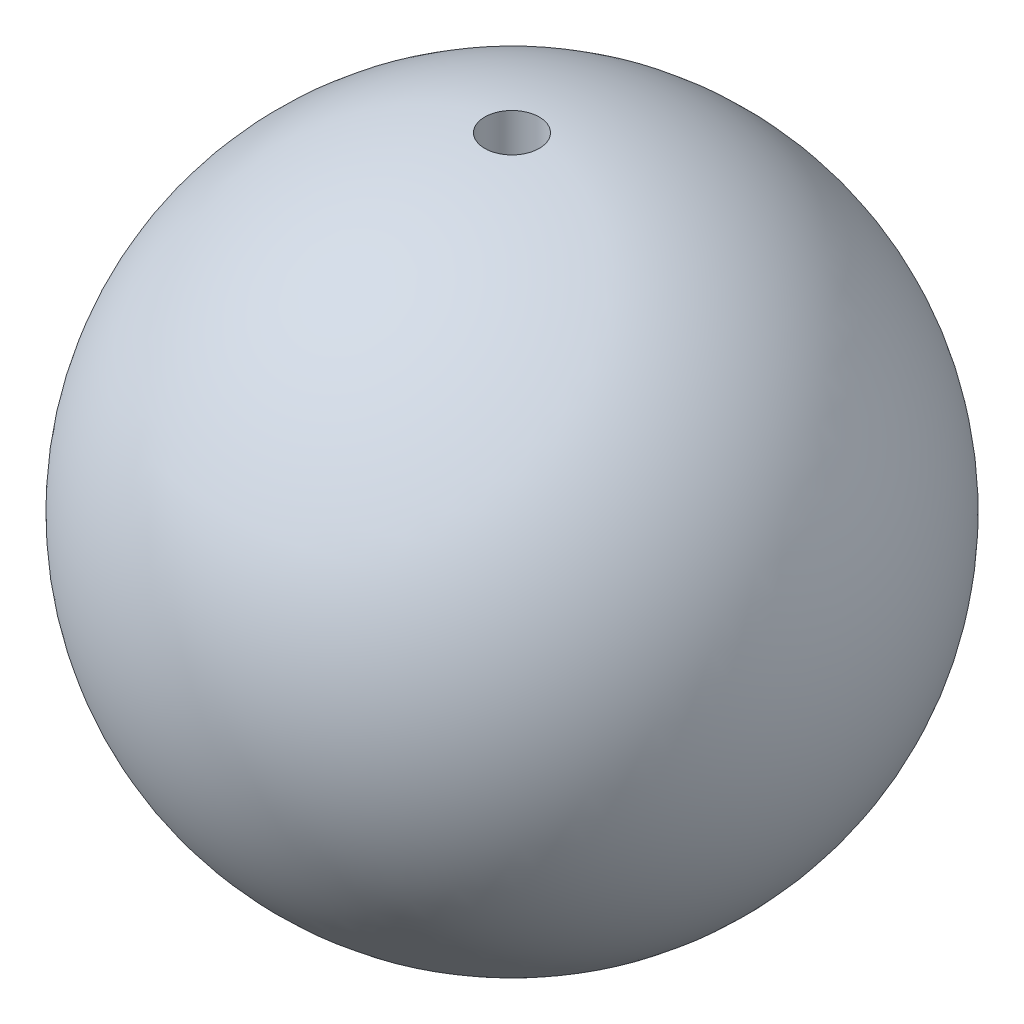
ISO-10303-21;
HEADER;
FILE_DESCRIPTION(('STEP AP214'),'2;1');
FILE_NAME('part.step','',(''),(''),'','','');
FILE_SCHEMA(('AUTOMOTIVE_DESIGN { 1 0 10303 214 1 1 1 1 }'));
ENDSEC;
DATA;
#1=APPLICATION_CONTEXT('core data for automotive mechanical design processes');
#2=APPLICATION_PROTOCOL_DEFINITION('international standard','automotive_design',2000,#1);
#3=PRODUCT_CONTEXT('',#1,'mechanical');
#4=PRODUCT('Part','Part','',(#3));
#5=PRODUCT_RELATED_PRODUCT_CATEGORY('part','',(#4));
#6=PRODUCT_DEFINITION_FORMATION('','',#4);
#7=PRODUCT_DEFINITION_CONTEXT('part definition',#1,'design');
#8=PRODUCT_DEFINITION('design','',#6,#7);
#9=PRODUCT_DEFINITION_SHAPE('','',#8);
#10=(LENGTH_UNIT() NAMED_UNIT(*) SI_UNIT(.MILLI.,.METRE.));
#11=(NAMED_UNIT(*) PLANE_ANGLE_UNIT() SI_UNIT($,.RADIAN.));
#12=(NAMED_UNIT(*) SI_UNIT($,.STERADIAN.) SOLID_ANGLE_UNIT());
#13=UNCERTAINTY_MEASURE_WITH_UNIT(LENGTH_MEASURE(1.E-05),#10,'distance_accuracy_value','');
#14=(GEOMETRIC_REPRESENTATION_CONTEXT(3) GLOBAL_UNCERTAINTY_ASSIGNED_CONTEXT((#13)) GLOBAL_UNIT_ASSIGNED_CONTEXT((#10,
#11,#12)) REPRESENTATION_CONTEXT('',''));
#15=CARTESIAN_POINT('',(0.,0.,0.));
#16=DIRECTION('',(0.,0.,1.));
#17=DIRECTION('',(1.,0.,0.));
#18=AXIS2_PLACEMENT_3D('',#15,#16,#17);
#19=CARTESIAN_POINT('',(0.,0.,0.));
#20=DIRECTION('',(0.,1.,0.));
#21=DIRECTION('',(1.,0.,0.));
#22=AXIS2_PLACEMENT_3D('',#19,#20,#21);
#23=SPHERICAL_SURFACE('',#22,19.05);
#24=CARTESIAN_POINT('',(0.,18.9847966794485,0.));
#25=DIRECTION('',(0.,-1.,0.));
#26=DIRECTION('',(0.,0.,-1.));
#27=AXIS2_PLACEMENT_3D('',#24,#25,#26);
#28=CIRCLE('',#27,1.5748);
#29=CARTESIAN_POINT('',(0.,18.9847966794485,-1.5748));
#30=VERTEX_POINT('',#29);
#31=EDGE_CURVE('E10',#30,#30,#28,.F.);
#32=ORIENTED_EDGE('',*,*,#31,.F.);
#33=EDGE_LOOP('',(#32));
#34=FACE_BOUND('',#33,.T.);
#35=ADVANCED_FACE('F32',(#34),#23,.T.);
#36=CARTESIAN_POINT('',(0.,19.05,0.));
#37=DIRECTION('',(0.,-1.,0.));
#38=DIRECTION('',(0.,0.,-1.));
#39=AXIS2_PLACEMENT_3D('',#36,#37,#38);
#40=CYLINDRICAL_SURFACE('',#39,1.5748);
#41=CARTESIAN_POINT('',(0.,0.,0.));
#42=DIRECTION('',(0.,1.,0.));
#43=DIRECTION('',(0.,0.,1.));
#44=AXIS2_PLACEMENT_3D('',#41,#42,#43);
#45=CIRCLE('',#44,1.5748);
#46=CARTESIAN_POINT('',(0.,0.,1.5748));
#47=VERTEX_POINT('',#46);
#48=EDGE_CURVE('E38',#47,#47,#45,.T.);
#49=ORIENTED_EDGE('',*,*,#48,.F.);
#50=EDGE_LOOP('',(#49));
#51=FACE_BOUND('',#50,.T.);
#52=ORIENTED_EDGE('',*,*,#31,.T.);
#53=EDGE_LOOP('',(#52));
#54=FACE_BOUND('',#53,.T.);
#55=ADVANCED_FACE('F46',(#51,#54),#40,.F.);
#56=CARTESIAN_POINT('',(0.,0.,0.));
#57=DIRECTION('',(0.,1.,0.));
#58=DIRECTION('',(0.,0.,1.));
#59=AXIS2_PLACEMENT_3D('',#56,#57,#58);
#60=PLANE('',#59);
#61=ORIENTED_EDGE('',*,*,#48,.T.);
#62=EDGE_LOOP('',(#61));
#63=FACE_BOUND('',#62,.T.);
#64=ADVANCED_FACE('F44',(#63),#60,.T.);
#65=CLOSED_SHELL('',(#35,#55,#64));
#66=MANIFOLD_SOLID_BREP('B2',#65);
#67=ADVANCED_BREP_SHAPE_REPRESENTATION('',(#18,#66),#14);
#68=SHAPE_DEFINITION_REPRESENTATION(#9,#67);
ENDSEC;
END-ISO-10303-21;
